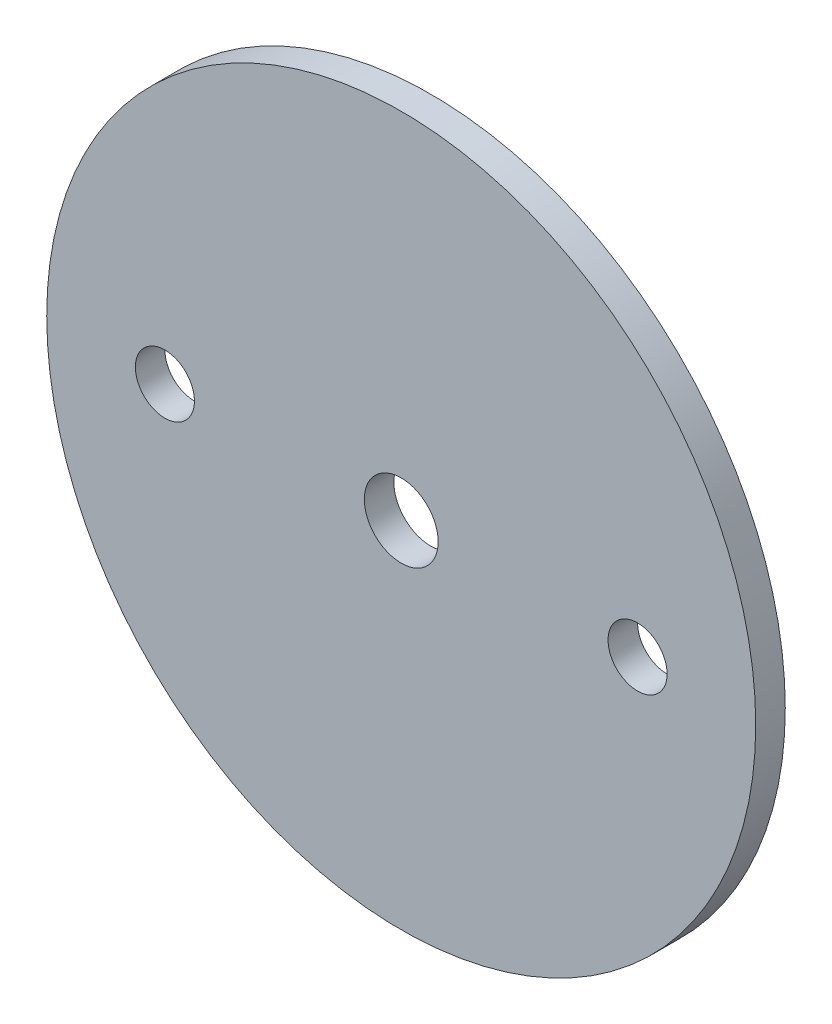
ISO-10303-21;
HEADER;
FILE_DESCRIPTION(('STEP AP214'),'2;1');
FILE_NAME('part.step','',(''),(''),'','','');
FILE_SCHEMA(('AUTOMOTIVE_DESIGN { 1 0 10303 214 1 1 1 1 }'));
ENDSEC;
DATA;
#1=APPLICATION_CONTEXT('core data for automotive mechanical design processes');
#2=APPLICATION_PROTOCOL_DEFINITION('international standard','automotive_design',2000,#1);
#3=PRODUCT_CONTEXT('',#1,'mechanical');
#4=PRODUCT('Part','Part','',(#3));
#5=PRODUCT_RELATED_PRODUCT_CATEGORY('part','',(#4));
#6=PRODUCT_DEFINITION_FORMATION('','',#4);
#7=PRODUCT_DEFINITION_CONTEXT('part definition',#1,'design');
#8=PRODUCT_DEFINITION('design','',#6,#7);
#9=PRODUCT_DEFINITION_SHAPE('','',#8);
#10=(LENGTH_UNIT() NAMED_UNIT(*) SI_UNIT(.MILLI.,.METRE.));
#11=(NAMED_UNIT(*) PLANE_ANGLE_UNIT() SI_UNIT($,.RADIAN.));
#12=(NAMED_UNIT(*) SI_UNIT($,.STERADIAN.) SOLID_ANGLE_UNIT());
#13=UNCERTAINTY_MEASURE_WITH_UNIT(LENGTH_MEASURE(1.E-05),#10,'distance_accuracy_value','');
#14=(GEOMETRIC_REPRESENTATION_CONTEXT(3) GLOBAL_UNCERTAINTY_ASSIGNED_CONTEXT((#13)) GLOBAL_UNIT_ASSIGNED_CONTEXT((#10,
#11,#12)) REPRESENTATION_CONTEXT('',''));
#15=CARTESIAN_POINT('',(0.,0.,0.));
#16=DIRECTION('',(0.,0.,1.));
#17=DIRECTION('',(1.,0.,0.));
#18=AXIS2_PLACEMENT_3D('',#15,#16,#17);
#19=CARTESIAN_POINT('',(0.,0.,1.5875));
#20=DIRECTION('',(0.,0.,-1.));
#21=DIRECTION('',(-1.,0.,0.));
#22=AXIS2_PLACEMENT_3D('',#19,#20,#21);
#23=CYLINDRICAL_SURFACE('',#22,38.1);
#24=CARTESIAN_POINT('',(0.,0.,1.5875));
#25=DIRECTION('',(0.,0.,1.));
#26=DIRECTION('',(1.,0.,0.));
#27=AXIS2_PLACEMENT_3D('',#24,#25,#26);
#28=CIRCLE('',#27,38.1);
#29=CARTESIAN_POINT('',(38.1,0.,1.5875));
#30=VERTEX_POINT('',#29);
#31=EDGE_CURVE('E10',#30,#30,#28,.T.);
#32=ORIENTED_EDGE('',*,*,#31,.F.);
#33=EDGE_LOOP('',(#32));
#34=FACE_BOUND('',#33,.T.);
#35=CARTESIAN_POINT('',(0.,0.,-1.5875));
#36=DIRECTION('',(0.,0.,1.));
#37=DIRECTION('',(1.,0.,0.));
#38=AXIS2_PLACEMENT_3D('',#35,#36,#37);
#39=CIRCLE('',#38,38.1);
#40=CARTESIAN_POINT('',(38.1,0.,-1.5875));
#41=VERTEX_POINT('',#40);
#42=EDGE_CURVE('E40',#41,#41,#39,.T.);
#43=ORIENTED_EDGE('',*,*,#42,.T.);
#44=EDGE_LOOP('',(#43));
#45=FACE_BOUND('',#44,.T.);
#46=ADVANCED_FACE('F37',(#34,#45),#23,.T.);
#47=CARTESIAN_POINT('',(0.,0.,1.5875));
#48=DIRECTION('',(0.,0.,1.));
#49=DIRECTION('',(1.,0.,0.));
#50=AXIS2_PLACEMENT_3D('',#47,#48,#49);
#51=PLANE('',#50);
#52=CARTESIAN_POINT('',(0.,0.,1.5875));
#53=DIRECTION('',(0.,0.,1.));
#54=DIRECTION('',(1.,0.,0.));
#55=AXIS2_PLACEMENT_3D('',#52,#53,#54);
#56=CIRCLE('',#55,3.96875);
#57=CARTESIAN_POINT('',(3.96875,0.,1.5875));
#58=VERTEX_POINT('',#57);
#59=EDGE_CURVE('E63',#58,#58,#56,.T.);
#60=ORIENTED_EDGE('',*,*,#59,.F.);
#61=EDGE_LOOP('',(#60));
#62=FACE_BOUND('',#61,.T.);
#63=CARTESIAN_POINT('',(25.4,0.,1.5875));
#64=DIRECTION('',(0.,0.,1.));
#65=DIRECTION('',(1.,0.,0.));
#66=AXIS2_PLACEMENT_3D('',#63,#64,#65);
#67=CIRCLE('',#66,3.17499999999999);
#68=CARTESIAN_POINT('',(28.575,0.,1.5875));
#69=VERTEX_POINT('',#68);
#70=EDGE_CURVE('E57',#69,#69,#67,.T.);
#71=ORIENTED_EDGE('',*,*,#70,.F.);
#72=EDGE_LOOP('',(#71));
#73=FACE_BOUND('',#72,.T.);
#74=CARTESIAN_POINT('',(-25.4,0.,1.5875));
#75=DIRECTION('',(0.,0.,1.));
#76=DIRECTION('',(1.,0.,0.));
#77=AXIS2_PLACEMENT_3D('',#74,#75,#76);
#78=CIRCLE('',#77,3.17499999999999);
#79=CARTESIAN_POINT('',(-22.225,0.,1.5875));
#80=VERTEX_POINT('',#79);
#81=EDGE_CURVE('E51',#80,#80,#78,.T.);
#82=ORIENTED_EDGE('',*,*,#81,.F.);
#83=EDGE_LOOP('',(#82));
#84=FACE_BOUND('',#83,.T.);
#85=ORIENTED_EDGE('',*,*,#31,.T.);
#86=EDGE_LOOP('',(#85));
#87=FACE_BOUND('',#86,.T.);
#88=ADVANCED_FACE('F70',(#62,#73,#84,#87),#51,.T.);
#89=CARTESIAN_POINT('',(0.,0.,-1.5875));
#90=DIRECTION('',(0.,0.,1.));
#91=DIRECTION('',(1.,0.,0.));
#92=AXIS2_PLACEMENT_3D('',#89,#90,#91);
#93=PLANE('',#92);
#94=CARTESIAN_POINT('',(0.,0.,-1.5875));
#95=DIRECTION('',(0.,0.,1.));
#96=DIRECTION('',(1.,0.,0.));
#97=AXIS2_PLACEMENT_3D('',#94,#95,#96);
#98=CIRCLE('',#97,3.96875);
#99=CARTESIAN_POINT('',(3.96875,0.,-1.5875));
#100=VERTEX_POINT('',#99);
#101=EDGE_CURVE('E60',#100,#100,#98,.T.);
#102=ORIENTED_EDGE('',*,*,#101,.T.);
#103=EDGE_LOOP('',(#102));
#104=FACE_BOUND('',#103,.T.);
#105=CARTESIAN_POINT('',(25.4,0.,-1.5875));
#106=DIRECTION('',(0.,0.,1.));
#107=DIRECTION('',(1.,0.,0.));
#108=AXIS2_PLACEMENT_3D('',#105,#106,#107);
#109=CIRCLE('',#108,3.175);
#110=CARTESIAN_POINT('',(28.575,0.,-1.5875));
#111=VERTEX_POINT('',#110);
#112=EDGE_CURVE('E54',#111,#111,#109,.T.);
#113=ORIENTED_EDGE('',*,*,#112,.T.);
#114=EDGE_LOOP('',(#113));
#115=FACE_BOUND('',#114,.T.);
#116=CARTESIAN_POINT('',(-25.4,0.,-1.5875));
#117=DIRECTION('',(0.,0.,1.));
#118=DIRECTION('',(1.,0.,0.));
#119=AXIS2_PLACEMENT_3D('',#116,#117,#118);
#120=CIRCLE('',#119,3.175);
#121=CARTESIAN_POINT('',(-22.225,0.,-1.5875));
#122=VERTEX_POINT('',#121);
#123=EDGE_CURVE('E47',#122,#122,#120,.T.);
#124=ORIENTED_EDGE('',*,*,#123,.T.);
#125=EDGE_LOOP('',(#124));
#126=FACE_BOUND('',#125,.T.);
#127=ORIENTED_EDGE('',*,*,#42,.F.);
#128=EDGE_LOOP('',(#127));
#129=FACE_BOUND('',#128,.T.);
#130=ADVANCED_FACE('F73',(#104,#115,#126,#129),#93,.F.);
#131=CARTESIAN_POINT('',(-25.4,0.,1.5875));
#132=DIRECTION('',(0.,0.,1.));
#133=DIRECTION('',(1.,0.,0.));
#134=AXIS2_PLACEMENT_3D('',#131,#132,#133);
#135=CYLINDRICAL_SURFACE('',#134,3.17499999999999);
#136=ORIENTED_EDGE('',*,*,#123,.F.);
#137=EDGE_LOOP('',(#136));
#138=FACE_BOUND('',#137,.T.);
#139=ORIENTED_EDGE('',*,*,#81,.T.);
#140=EDGE_LOOP('',(#139));
#141=FACE_BOUND('',#140,.T.);
#142=ADVANCED_FACE('F79',(#138,#141),#135,.F.);
#143=CARTESIAN_POINT('',(25.4,0.,1.5875));
#144=DIRECTION('',(0.,0.,1.));
#145=DIRECTION('',(1.,0.,0.));
#146=AXIS2_PLACEMENT_3D('',#143,#144,#145);
#147=CYLINDRICAL_SURFACE('',#146,3.17499999999999);
#148=ORIENTED_EDGE('',*,*,#112,.F.);
#149=EDGE_LOOP('',(#148));
#150=FACE_BOUND('',#149,.T.);
#151=ORIENTED_EDGE('',*,*,#70,.T.);
#152=EDGE_LOOP('',(#151));
#153=FACE_BOUND('',#152,.T.);
#154=ADVANCED_FACE('F81',(#150,#153),#147,.F.);
#155=CARTESIAN_POINT('',(0.,0.,1.5875));
#156=DIRECTION('',(0.,0.,1.));
#157=DIRECTION('',(1.,0.,0.));
#158=AXIS2_PLACEMENT_3D('',#155,#156,#157);
#159=CYLINDRICAL_SURFACE('',#158,3.96875);
#160=ORIENTED_EDGE('',*,*,#59,.T.);
#161=EDGE_LOOP('',(#160));
#162=FACE_BOUND('',#161,.T.);
#163=ORIENTED_EDGE('',*,*,#101,.F.);
#164=EDGE_LOOP('',(#163));
#165=FACE_BOUND('',#164,.T.);
#166=ADVANCED_FACE('F67',(#162,#165),#159,.F.);
#167=CLOSED_SHELL('',(#46,#88,#130,#142,#154,#166));
#168=MANIFOLD_SOLID_BREP('B2',#167);
#169=ADVANCED_BREP_SHAPE_REPRESENTATION('',(#18,#168),#14);
#170=SHAPE_DEFINITION_REPRESENTATION(#9,#169);
ENDSEC;
END-ISO-10303-21;
